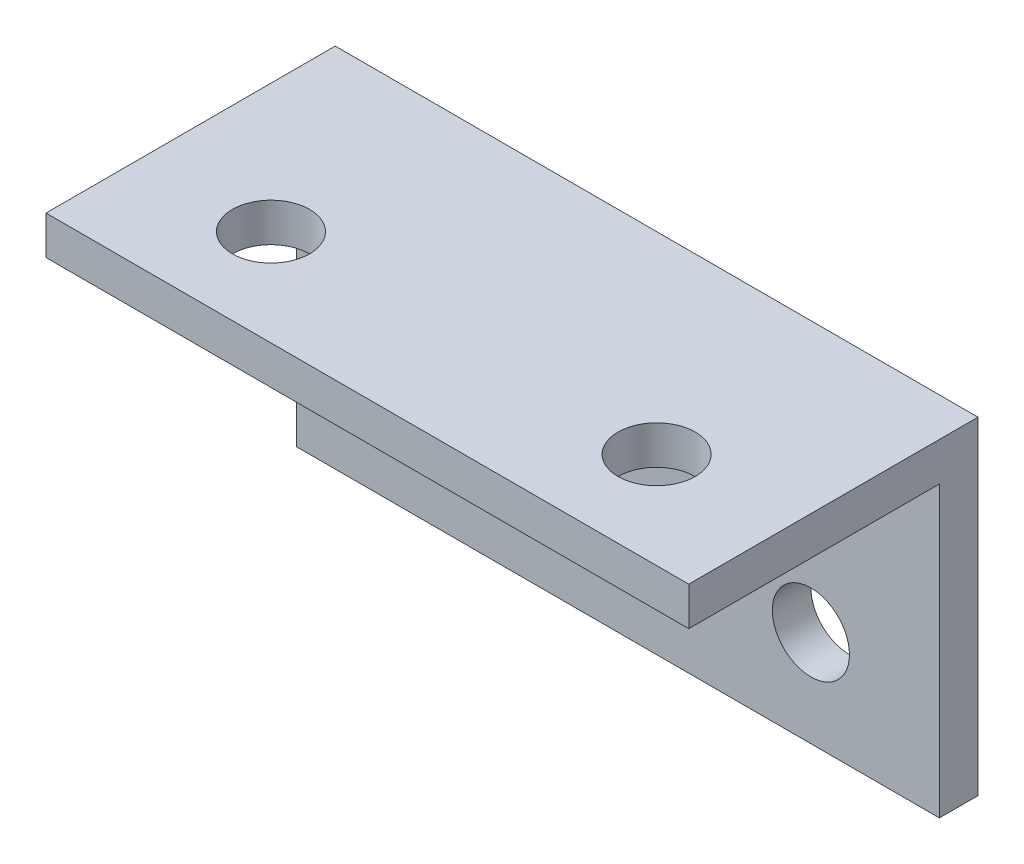
ISO-10303-21;
HEADER;
FILE_DESCRIPTION(('STEP AP214'),'2;1');
FILE_NAME('part.step','',(''),(''),'','','');
FILE_SCHEMA(('AUTOMOTIVE_DESIGN { 1 0 10303 214 1 1 1 1 }'));
ENDSEC;
DATA;
#1=APPLICATION_CONTEXT('core data for automotive mechanical design processes');
#2=APPLICATION_PROTOCOL_DEFINITION('international standard','automotive_design',2000,#1);
#3=PRODUCT_CONTEXT('',#1,'mechanical');
#4=PRODUCT('Part','Part','',(#3));
#5=PRODUCT_RELATED_PRODUCT_CATEGORY('part','',(#4));
#6=PRODUCT_DEFINITION_FORMATION('','',#4);
#7=PRODUCT_DEFINITION_CONTEXT('part definition',#1,'design');
#8=PRODUCT_DEFINITION('design','',#6,#7);
#9=PRODUCT_DEFINITION_SHAPE('','',#8);
#10=(LENGTH_UNIT() NAMED_UNIT(*) SI_UNIT(.MILLI.,.METRE.));
#11=(NAMED_UNIT(*) PLANE_ANGLE_UNIT() SI_UNIT($,.RADIAN.));
#12=(NAMED_UNIT(*) SI_UNIT($,.STERADIAN.) SOLID_ANGLE_UNIT());
#13=UNCERTAINTY_MEASURE_WITH_UNIT(LENGTH_MEASURE(1.E-05),#10,'distance_accuracy_value','');
#14=(GEOMETRIC_REPRESENTATION_CONTEXT(3) GLOBAL_UNCERTAINTY_ASSIGNED_CONTEXT((#13)) GLOBAL_UNIT_ASSIGNED_CONTEXT((#10,
#11,#12)) REPRESENTATION_CONTEXT('',''));
#15=CARTESIAN_POINT('',(0.,0.,0.));
#16=DIRECTION('',(0.,0.,1.));
#17=DIRECTION('',(1.,0.,0.));
#18=AXIS2_PLACEMENT_3D('',#15,#16,#17);
#19=CARTESIAN_POINT('',(0.,0.,3.));
#20=DIRECTION('',(0.,0.,1.));
#21=DIRECTION('',(1.,0.,0.));
#22=AXIS2_PLACEMENT_3D('',#19,#20,#21);
#23=PLANE('',#22);
#24=CARTESIAN_POINT('',(-2.80616309658022,-17.0533186592939,3.));
#25=DIRECTION('',(0.,0.,1.));
#26=DIRECTION('',(1.,0.,0.));
#27=AXIS2_PLACEMENT_3D('',#24,#25,#26);
#28=CIRCLE('',#27,3.);
#29=CARTESIAN_POINT('',(0.19383690341978,-17.0533186592939,3.));
#30=VERTEX_POINT('',#29);
#31=EDGE_CURVE('E107',#30,#30,#28,.T.);
#32=ORIENTED_EDGE('',*,*,#31,.F.);
#33=EDGE_LOOP('',(#32));
#34=FACE_BOUND('',#33,.T.);
#35=DIRECTION('',(0.,1.,0.));
#36=VECTOR('',#35,1.);
#37=CARTESIAN_POINT('',(7.19383690341978,-24.5533186592939,3.));
#38=LINE('',#37,#36);
#39=CARTESIAN_POINT('',(7.19383690341978,-24.5533186592939,3.));
#40=VERTEX_POINT('',#39);
#41=CARTESIAN_POINT('',(7.19383690341978,-2.05331865929385,3.));
#42=VERTEX_POINT('',#41);
#43=EDGE_CURVE('E97',#40,#42,#38,.T.);
#44=ORIENTED_EDGE('',*,*,#43,.T.);
#45=DIRECTION('',(-1.,0.,0.));
#46=VECTOR('',#45,1.);
#47=CARTESIAN_POINT('',(7.19383690341978,-2.05331865929385,3.));
#48=LINE('',#47,#46);
#49=CARTESIAN_POINT('',(-42.8061630965802,-2.05331865929386,3.));
#50=VERTEX_POINT('',#49);
#51=EDGE_CURVE('E75',#42,#50,#48,.T.);
#52=ORIENTED_EDGE('',*,*,#51,.T.);
#53=DIRECTION('',(0.,-1.,0.));
#54=VECTOR('',#53,1.);
#55=CARTESIAN_POINT('',(-42.8061630965802,-24.5533186592939,3.));
#56=LINE('',#55,#54);
#57=CARTESIAN_POINT('',(-42.8061630965802,-24.5533186592939,3.));
#58=VERTEX_POINT('',#57);
#59=EDGE_CURVE('E95',#50,#58,#56,.T.);
#60=ORIENTED_EDGE('',*,*,#59,.T.);
#61=DIRECTION('',(1.,0.,0.));
#62=VECTOR('',#61,1.);
#63=CARTESIAN_POINT('',(7.19383690341978,-24.5533186592939,3.));
#64=LINE('',#63,#62);
#65=EDGE_CURVE('E54',#58,#40,#64,.T.);
#66=ORIENTED_EDGE('',*,*,#65,.T.);
#67=EDGE_LOOP('',(#44,#52,#60,#66));
#68=FACE_BOUND('',#67,.T.);
#69=CARTESIAN_POINT('',(-32.8061630965802,-17.0533186592939,3.));
#70=DIRECTION('',(0.,0.,1.));
#71=DIRECTION('',(-1.,0.,0.));
#72=AXIS2_PLACEMENT_3D('',#69,#70,#71);
#73=CIRCLE('',#72,3.00000000000001);
#74=CARTESIAN_POINT('',(-35.8061630965802,-17.0533186592939,3.));
#75=VERTEX_POINT('',#74);
#76=EDGE_CURVE('E143',#75,#75,#73,.T.);
#77=ORIENTED_EDGE('',*,*,#76,.F.);
#78=EDGE_LOOP('',(#77));
#79=FACE_BOUND('',#78,.T.);
#80=ADVANCED_FACE('F37',(#34,#68,#79),#23,.T.);
#81=CARTESIAN_POINT('',(0.,0.,0.));
#82=DIRECTION('',(0.,0.,1.));
#83=DIRECTION('',(1.,0.,0.));
#84=AXIS2_PLACEMENT_3D('',#81,#82,#83);
#85=PLANE('',#84);
#86=DIRECTION('',(0.,1.,0.));
#87=VECTOR('',#86,1.);
#88=CARTESIAN_POINT('',(7.19383690341978,-24.5533186592939,0.));
#89=LINE('',#88,#87);
#90=CARTESIAN_POINT('',(7.19383690341978,-24.5533186592939,0.));
#91=VERTEX_POINT('',#90);
#92=CARTESIAN_POINT('',(7.19383690341978,0.946681340706146,0.));
#93=VERTEX_POINT('',#92);
#94=EDGE_CURVE('E104',#91,#93,#89,.T.);
#95=ORIENTED_EDGE('',*,*,#94,.F.);
#96=DIRECTION('',(1.,0.,0.));
#97=VECTOR('',#96,1.);
#98=CARTESIAN_POINT('',(7.19383690341978,-24.5533186592939,0.));
#99=LINE('',#98,#97);
#100=CARTESIAN_POINT('',(-42.8061630965802,-24.5533186592939,0.));
#101=VERTEX_POINT('',#100);
#102=EDGE_CURVE('E109',#101,#91,#99,.T.);
#103=ORIENTED_EDGE('',*,*,#102,.F.);
#104=DIRECTION('',(0.,-1.,0.));
#105=VECTOR('',#104,1.);
#106=CARTESIAN_POINT('',(-42.8061630965802,-24.5533186592939,0.));
#107=LINE('',#106,#105);
#108=CARTESIAN_POINT('',(-42.8061630965802,0.94668134070614,0.));
#109=VERTEX_POINT('',#108);
#110=EDGE_CURVE('E66',#109,#101,#107,.T.);
#111=ORIENTED_EDGE('',*,*,#110,.F.);
#112=DIRECTION('',(-1.,0.,0.));
#113=VECTOR('',#112,1.);
#114=CARTESIAN_POINT('',(-42.8061630965802,0.94668134070614,0.));
#115=LINE('',#114,#113);
#116=EDGE_CURVE('E122',#93,#109,#115,.T.);
#117=ORIENTED_EDGE('',*,*,#116,.F.);
#118=EDGE_LOOP('',(#95,#103,#111,#117));
#119=FACE_BOUND('',#118,.T.);
#120=CARTESIAN_POINT('',(-2.80616309658022,-17.0533186592939,0.));
#121=DIRECTION('',(0.,0.,1.));
#122=DIRECTION('',(1.,0.,0.));
#123=AXIS2_PLACEMENT_3D('',#120,#121,#122);
#124=CIRCLE('',#123,3.);
#125=CARTESIAN_POINT('',(0.19383690341978,-17.0533186592939,0.));
#126=VERTEX_POINT('',#125);
#127=EDGE_CURVE('E146',#126,#126,#124,.T.);
#128=ORIENTED_EDGE('',*,*,#127,.T.);
#129=EDGE_LOOP('',(#128));
#130=FACE_BOUND('',#129,.T.);
#131=CARTESIAN_POINT('',(-32.8061630965802,-17.0533186592939,0.));
#132=DIRECTION('',(0.,0.,1.));
#133=DIRECTION('',(-1.,0.,0.));
#134=AXIS2_PLACEMENT_3D('',#131,#132,#133);
#135=CIRCLE('',#134,3.00000000000001);
#136=CARTESIAN_POINT('',(-35.8061630965802,-17.0533186592939,0.));
#137=VERTEX_POINT('',#136);
#138=EDGE_CURVE('E142',#137,#137,#135,.T.);
#139=ORIENTED_EDGE('',*,*,#138,.T.);
#140=EDGE_LOOP('',(#139));
#141=FACE_BOUND('',#140,.T.);
#142=ADVANCED_FACE('F119',(#119,#130,#141),#85,.F.);
#143=CARTESIAN_POINT('',(7.19383690341978,-24.5533186592939,3.));
#144=DIRECTION('',(-1.,0.,0.));
#145=DIRECTION('',(0.,0.,1.));
#146=AXIS2_PLACEMENT_3D('',#143,#144,#145);
#147=PLANE('',#146);
#148=ORIENTED_EDGE('',*,*,#94,.T.);
#149=DIRECTION('',(0.,0.,-1.));
#150=VECTOR('',#149,1.);
#151=CARTESIAN_POINT('',(7.19383690341978,0.946681340706146,0.));
#152=LINE('',#151,#150);
#153=CARTESIAN_POINT('',(7.19383690341978,0.946681340706146,22.5));
#154=VERTEX_POINT('',#153);
#155=EDGE_CURVE('E128',#154,#93,#152,.T.);
#156=ORIENTED_EDGE('',*,*,#155,.F.);
#157=DIRECTION('',(0.,-1.,0.));
#158=VECTOR('',#157,1.);
#159=CARTESIAN_POINT('',(7.19383690341978,0.946681340706146,22.5));
#160=LINE('',#159,#158);
#161=CARTESIAN_POINT('',(7.19383690341978,-2.05331865929385,22.5));
#162=VERTEX_POINT('',#161);
#163=EDGE_CURVE('E127',#154,#162,#160,.T.);
#164=ORIENTED_EDGE('',*,*,#163,.T.);
#165=DIRECTION('',(0.,0.,-1.));
#166=VECTOR('',#165,1.);
#167=CARTESIAN_POINT('',(7.19383690341978,-2.05331865929385,0.));
#168=LINE('',#167,#166);
#169=EDGE_CURVE('E138',#162,#42,#168,.T.);
#170=ORIENTED_EDGE('',*,*,#169,.T.);
#171=ORIENTED_EDGE('',*,*,#43,.F.);
#172=DIRECTION('',(0.,0.,-1.));
#173=VECTOR('',#172,1.);
#174=CARTESIAN_POINT('',(7.19383690341978,-24.5533186592939,3.));
#175=LINE('',#174,#173);
#176=EDGE_CURVE('E46',#40,#91,#175,.T.);
#177=ORIENTED_EDGE('',*,*,#176,.T.);
#178=EDGE_LOOP('',(#148,#156,#164,#170,#171,#177));
#179=FACE_BOUND('',#178,.T.);
#180=ADVANCED_FACE('F39',(#179),#147,.F.);
#181=CARTESIAN_POINT('',(-42.8061630965802,-24.5533186592939,3.));
#182=DIRECTION('',(1.,0.,0.));
#183=DIRECTION('',(0.,0.,-1.));
#184=AXIS2_PLACEMENT_3D('',#181,#182,#183);
#185=PLANE('',#184);
#186=ORIENTED_EDGE('',*,*,#110,.T.);
#187=DIRECTION('',(0.,0.,-1.));
#188=VECTOR('',#187,1.);
#189=CARTESIAN_POINT('',(-42.8061630965802,-24.5533186592939,3.));
#190=LINE('',#189,#188);
#191=EDGE_CURVE('E11',#58,#101,#190,.T.);
#192=ORIENTED_EDGE('',*,*,#191,.F.);
#193=ORIENTED_EDGE('',*,*,#59,.F.);
#194=DIRECTION('',(0.,0.,1.));
#195=VECTOR('',#194,1.);
#196=CARTESIAN_POINT('',(-42.8061630965802,-2.05331865929386,22.5));
#197=LINE('',#196,#195);
#198=CARTESIAN_POINT('',(-42.8061630965802,-2.05331865929386,22.5));
#199=VERTEX_POINT('',#198);
#200=EDGE_CURVE('E84',#50,#199,#197,.T.);
#201=ORIENTED_EDGE('',*,*,#200,.T.);
#202=DIRECTION('',(0.,-1.,0.));
#203=VECTOR('',#202,1.);
#204=CARTESIAN_POINT('',(-42.8061630965802,0.94668134070614,22.5));
#205=LINE('',#204,#203);
#206=CARTESIAN_POINT('',(-42.8061630965802,0.94668134070614,22.5));
#207=VERTEX_POINT('',#206);
#208=EDGE_CURVE('E131',#207,#199,#205,.T.);
#209=ORIENTED_EDGE('',*,*,#208,.F.);
#210=DIRECTION('',(0.,0.,1.));
#211=VECTOR('',#210,1.);
#212=CARTESIAN_POINT('',(-42.8061630965802,0.94668134070614,22.5));
#213=LINE('',#212,#211);
#214=EDGE_CURVE('E139',#109,#207,#213,.T.);
#215=ORIENTED_EDGE('',*,*,#214,.F.);
#216=EDGE_LOOP('',(#186,#192,#193,#201,#209,#215));
#217=FACE_BOUND('',#216,.T.);
#218=ADVANCED_FACE('F99',(#217),#185,.F.);
#219=CARTESIAN_POINT('',(7.19383690341978,-24.5533186592939,3.));
#220=DIRECTION('',(0.,1.,0.));
#221=DIRECTION('',(-1.,0.,0.));
#222=AXIS2_PLACEMENT_3D('',#219,#220,#221);
#223=PLANE('',#222);
#224=ORIENTED_EDGE('',*,*,#102,.T.);
#225=ORIENTED_EDGE('',*,*,#176,.F.);
#226=ORIENTED_EDGE('',*,*,#65,.F.);
#227=ORIENTED_EDGE('',*,*,#191,.T.);
#228=EDGE_LOOP('',(#224,#225,#226,#227));
#229=FACE_BOUND('',#228,.T.);
#230=ADVANCED_FACE('F158',(#229),#223,.F.);
#231=CARTESIAN_POINT('',(-2.80616309658022,-17.0533186592939,3.));
#232=DIRECTION('',(0.,0.,-1.));
#233=DIRECTION('',(-1.,0.,0.));
#234=AXIS2_PLACEMENT_3D('',#231,#232,#233);
#235=CYLINDRICAL_SURFACE('',#234,3.);
#236=ORIENTED_EDGE('',*,*,#31,.T.);
#237=EDGE_LOOP('',(#236));
#238=FACE_BOUND('',#237,.T.);
#239=ORIENTED_EDGE('',*,*,#127,.F.);
#240=EDGE_LOOP('',(#239));
#241=FACE_BOUND('',#240,.T.);
#242=ADVANCED_FACE('F155',(#238,#241),#235,.F.);
#243=CARTESIAN_POINT('',(-32.8061630965802,-17.0533186592939,3.));
#244=DIRECTION('',(0.,0.,-1.));
#245=DIRECTION('',(-1.,0.,0.));
#246=AXIS2_PLACEMENT_3D('',#243,#244,#245);
#247=CYLINDRICAL_SURFACE('',#246,3.00000000000001);
#248=ORIENTED_EDGE('',*,*,#76,.T.);
#249=EDGE_LOOP('',(#248));
#250=FACE_BOUND('',#249,.T.);
#251=ORIENTED_EDGE('',*,*,#138,.F.);
#252=EDGE_LOOP('',(#251));
#253=FACE_BOUND('',#252,.T.);
#254=ADVANCED_FACE('F157',(#250,#253),#247,.F.);
#255=CARTESIAN_POINT('',(0.,-2.05331865929386,0.));
#256=DIRECTION('',(0.,-1.,0.));
#257=DIRECTION('',(1.,0.,0.));
#258=AXIS2_PLACEMENT_3D('',#255,#256,#257);
#259=PLANE('',#258);
#260=CARTESIAN_POINT('',(-32.8061630965802,-2.05331865929386,15.));
#261=DIRECTION('',(0.,1.,0.));
#262=DIRECTION('',(1.,0.,0.));
#263=AXIS2_PLACEMENT_3D('',#260,#261,#262);
#264=CIRCLE('',#263,3.00000000000001);
#265=CARTESIAN_POINT('',(-29.8061630965802,-2.05331865929386,15.));
#266=VERTEX_POINT('',#265);
#267=EDGE_CURVE('E301',#266,#266,#264,.T.);
#268=ORIENTED_EDGE('',*,*,#267,.T.);
#269=EDGE_LOOP('',(#268));
#270=FACE_BOUND('',#269,.T.);
#271=CARTESIAN_POINT('',(-2.80616309658022,-2.05331865929386,15.));
#272=DIRECTION('',(0.,1.,0.));
#273=DIRECTION('',(-1.,0.,0.));
#274=AXIS2_PLACEMENT_3D('',#271,#272,#273);
#275=CIRCLE('',#274,3.);
#276=CARTESIAN_POINT('',(-5.80616309658022,-2.05331865929386,15.));
#277=VERTEX_POINT('',#276);
#278=EDGE_CURVE('E303',#277,#277,#275,.T.);
#279=ORIENTED_EDGE('',*,*,#278,.T.);
#280=EDGE_LOOP('',(#279));
#281=FACE_BOUND('',#280,.T.);
#282=ORIENTED_EDGE('',*,*,#51,.F.);
#283=ORIENTED_EDGE('',*,*,#169,.F.);
#284=DIRECTION('',(1.,0.,0.));
#285=VECTOR('',#284,1.);
#286=CARTESIAN_POINT('',(7.19383690341978,-2.05331865929385,22.5));
#287=LINE('',#286,#285);
#288=EDGE_CURVE('E88',#199,#162,#287,.T.);
#289=ORIENTED_EDGE('',*,*,#288,.F.);
#290=ORIENTED_EDGE('',*,*,#200,.F.);
#291=EDGE_LOOP('',(#282,#283,#289,#290));
#292=FACE_BOUND('',#291,.T.);
#293=ADVANCED_FACE('F85',(#270,#281,#292),#259,.T.);
#294=CARTESIAN_POINT('',(0.,0.946681340706145,0.));
#295=DIRECTION('',(0.,-1.,0.));
#296=DIRECTION('',(1.,0.,0.));
#297=AXIS2_PLACEMENT_3D('',#294,#295,#296);
#298=PLANE('',#297);
#299=ORIENTED_EDGE('',*,*,#214,.T.);
#300=DIRECTION('',(1.,0.,0.));
#301=VECTOR('',#300,1.);
#302=CARTESIAN_POINT('',(7.19383690341978,0.946681340706146,22.5));
#303=LINE('',#302,#301);
#304=EDGE_CURVE('E133',#207,#154,#303,.T.);
#305=ORIENTED_EDGE('',*,*,#304,.T.);
#306=ORIENTED_EDGE('',*,*,#155,.T.);
#307=ORIENTED_EDGE('',*,*,#116,.T.);
#308=EDGE_LOOP('',(#299,#305,#306,#307));
#309=FACE_BOUND('',#308,.T.);
#310=CARTESIAN_POINT('',(-2.80616309658022,0.946681340706145,15.));
#311=DIRECTION('',(0.,1.,0.));
#312=DIRECTION('',(-1.,0.,0.));
#313=AXIS2_PLACEMENT_3D('',#310,#311,#312);
#314=CIRCLE('',#313,3.);
#315=CARTESIAN_POINT('',(-5.80616309658022,0.946681340706144,15.));
#316=VERTEX_POINT('',#315);
#317=EDGE_CURVE('E92',#316,#316,#314,.T.);
#318=ORIENTED_EDGE('',*,*,#317,.F.);
#319=EDGE_LOOP('',(#318));
#320=FACE_BOUND('',#319,.T.);
#321=CARTESIAN_POINT('',(-32.8061630965802,0.946681340706141,15.));
#322=DIRECTION('',(0.,1.,0.));
#323=DIRECTION('',(1.,0.,0.));
#324=AXIS2_PLACEMENT_3D('',#321,#322,#323);
#325=CIRCLE('',#324,3.00000000000001);
#326=CARTESIAN_POINT('',(-29.8061630965802,0.946681340706142,15.));
#327=VERTEX_POINT('',#326);
#328=EDGE_CURVE('E298',#327,#327,#325,.T.);
#329=ORIENTED_EDGE('',*,*,#328,.F.);
#330=EDGE_LOOP('',(#329));
#331=FACE_BOUND('',#330,.T.);
#332=ADVANCED_FACE('F244',(#309,#320,#331),#298,.F.);
#333=CARTESIAN_POINT('',(7.19383690341978,0.946681340706146,22.5));
#334=DIRECTION('',(0.,0.,-1.));
#335=DIRECTION('',(-1.,0.,0.));
#336=AXIS2_PLACEMENT_3D('',#333,#334,#335);
#337=PLANE('',#336);
#338=ORIENTED_EDGE('',*,*,#288,.T.);
#339=ORIENTED_EDGE('',*,*,#163,.F.);
#340=ORIENTED_EDGE('',*,*,#304,.F.);
#341=ORIENTED_EDGE('',*,*,#208,.T.);
#342=EDGE_LOOP('',(#338,#339,#340,#341));
#343=FACE_BOUND('',#342,.T.);
#344=ADVANCED_FACE('F255',(#343),#337,.F.);
#345=CARTESIAN_POINT('',(-2.80616309658022,0.946681340706145,15.));
#346=DIRECTION('',(0.,-1.,0.));
#347=DIRECTION('',(1.,0.,0.));
#348=AXIS2_PLACEMENT_3D('',#345,#346,#347);
#349=CYLINDRICAL_SURFACE('',#348,3.);
#350=ORIENTED_EDGE('',*,*,#317,.T.);
#351=EDGE_LOOP('',(#350));
#352=FACE_BOUND('',#351,.T.);
#353=ORIENTED_EDGE('',*,*,#278,.F.);
#354=EDGE_LOOP('',(#353));
#355=FACE_BOUND('',#354,.T.);
#356=ADVANCED_FACE('F265',(#352,#355),#349,.F.);
#357=CARTESIAN_POINT('',(-32.8061630965802,0.946681340706141,15.));
#358=DIRECTION('',(0.,-1.,0.));
#359=DIRECTION('',(1.,0.,0.));
#360=AXIS2_PLACEMENT_3D('',#357,#358,#359);
#361=CYLINDRICAL_SURFACE('',#360,3.00000000000001);
#362=ORIENTED_EDGE('',*,*,#328,.T.);
#363=EDGE_LOOP('',(#362));
#364=FACE_BOUND('',#363,.T.);
#365=ORIENTED_EDGE('',*,*,#267,.F.);
#366=EDGE_LOOP('',(#365));
#367=FACE_BOUND('',#366,.T.);
#368=ADVANCED_FACE('F276',(#364,#367),#361,.F.);
#369=CLOSED_SHELL('',(#80,#142,#180,#218,#230,#242,#254,#293,#332,#344,#356,#368));
#370=MANIFOLD_SOLID_BREP('B2',#369);
#371=ADVANCED_BREP_SHAPE_REPRESENTATION('',(#18,#370),#14);
#372=SHAPE_DEFINITION_REPRESENTATION(#9,#371);
ENDSEC;
END-ISO-10303-21;
